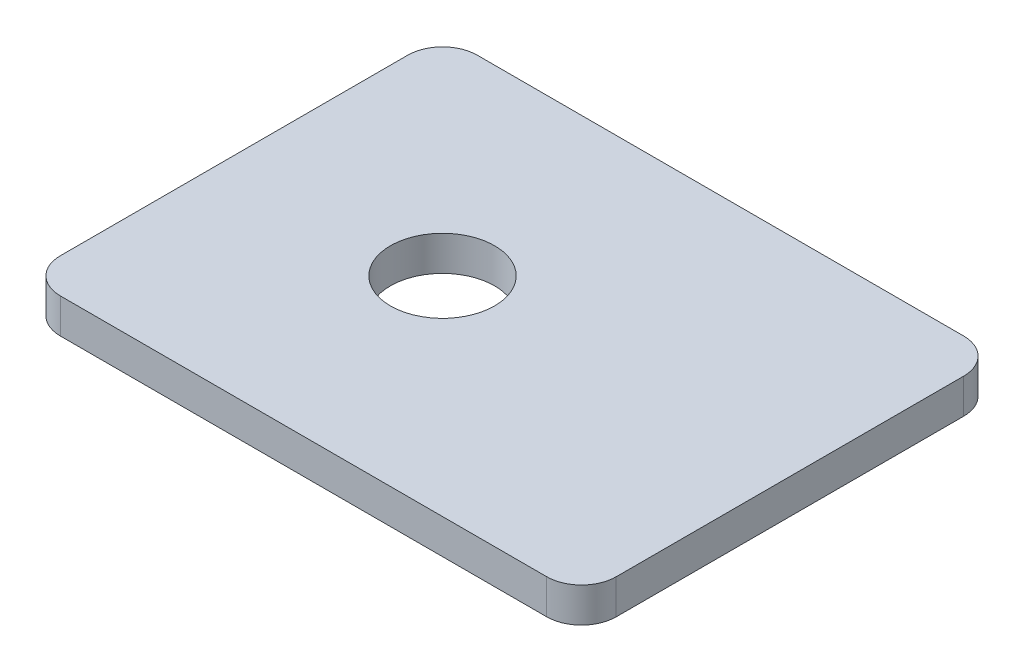
ISO-10303-21;
HEADER;
FILE_DESCRIPTION(('STEP AP214'),'2;1');
FILE_NAME('part.step','',(''),(''),'','','');
FILE_SCHEMA(('AUTOMOTIVE_DESIGN { 1 0 10303 214 1 1 1 1 }'));
ENDSEC;
DATA;
#1=APPLICATION_CONTEXT('core data for automotive mechanical design processes');
#2=APPLICATION_PROTOCOL_DEFINITION('international standard','automotive_design',2000,#1);
#3=PRODUCT_CONTEXT('',#1,'mechanical');
#4=PRODUCT('Part','Part','',(#3));
#5=PRODUCT_RELATED_PRODUCT_CATEGORY('part','',(#4));
#6=PRODUCT_DEFINITION_FORMATION('','',#4);
#7=PRODUCT_DEFINITION_CONTEXT('part definition',#1,'design');
#8=PRODUCT_DEFINITION('design','',#6,#7);
#9=PRODUCT_DEFINITION_SHAPE('','',#8);
#10=(LENGTH_UNIT() NAMED_UNIT(*) SI_UNIT(.MILLI.,.METRE.));
#11=(NAMED_UNIT(*) PLANE_ANGLE_UNIT() SI_UNIT($,.RADIAN.));
#12=(NAMED_UNIT(*) SI_UNIT($,.STERADIAN.) SOLID_ANGLE_UNIT());
#13=UNCERTAINTY_MEASURE_WITH_UNIT(LENGTH_MEASURE(1.E-05),#10,'distance_accuracy_value','');
#14=(GEOMETRIC_REPRESENTATION_CONTEXT(3) GLOBAL_UNCERTAINTY_ASSIGNED_CONTEXT((#13)) GLOBAL_UNIT_ASSIGNED_CONTEXT((#10,
#11,#12)) REPRESENTATION_CONTEXT('',''));
#15=CARTESIAN_POINT('',(0.,0.,0.));
#16=DIRECTION('',(0.,0.,1.));
#17=DIRECTION('',(1.,0.,0.));
#18=AXIS2_PLACEMENT_3D('',#15,#16,#17);
#19=CARTESIAN_POINT('',(3.175,0.,-3.175));
#20=DIRECTION('',(0.,-1.,0.));
#21=DIRECTION('',(0.,0.,-1.));
#22=AXIS2_PLACEMENT_3D('',#19,#20,#21);
#23=PLANE('',#22);
#24=CARTESIAN_POINT('',(3.175,0.,-3.175));
#25=DIRECTION('',(0.,-1.,0.));
#26=DIRECTION('',(0.,0.,-1.));
#27=AXIS2_PLACEMENT_3D('',#24,#25,#26);
#28=CIRCLE('',#27,3.175);
#29=CARTESIAN_POINT('',(3.175,0.,0.));
#30=VERTEX_POINT('',#29);
#31=CARTESIAN_POINT('',(0.,0.,-3.175));
#32=VERTEX_POINT('',#31);
#33=EDGE_CURVE('E145',#30,#32,#28,.T.);
#34=ORIENTED_EDGE('',*,*,#33,.T.);
#35=DIRECTION('',(0.,0.,-1.));
#36=VECTOR('',#35,1.);
#37=CARTESIAN_POINT('',(0.,0.,-3.175));
#38=LINE('',#37,#36);
#39=CARTESIAN_POINT('',(0.,0.,-34.925));
#40=VERTEX_POINT('',#39);
#41=EDGE_CURVE('E148',#32,#40,#38,.T.);
#42=ORIENTED_EDGE('',*,*,#41,.T.);
#43=CARTESIAN_POINT('',(3.175,0.,-34.925));
#44=DIRECTION('',(0.,-1.,0.));
#45=DIRECTION('',(0.,0.,-1.));
#46=AXIS2_PLACEMENT_3D('',#43,#44,#45);
#47=CIRCLE('',#46,3.175);
#48=CARTESIAN_POINT('',(3.175,0.,-38.1));
#49=VERTEX_POINT('',#48);
#50=EDGE_CURVE('E152',#40,#49,#47,.T.);
#51=ORIENTED_EDGE('',*,*,#50,.T.);
#52=DIRECTION('',(1.,0.,0.));
#53=VECTOR('',#52,1.);
#54=CARTESIAN_POINT('',(3.175,0.,-38.1));
#55=LINE('',#54,#53);
#56=CARTESIAN_POINT('',(47.625,0.,-38.1));
#57=VERTEX_POINT('',#56);
#58=EDGE_CURVE('E155',#49,#57,#55,.T.);
#59=ORIENTED_EDGE('',*,*,#58,.T.);
#60=CARTESIAN_POINT('',(47.625,0.,-34.925));
#61=DIRECTION('',(0.,-1.,0.));
#62=DIRECTION('',(0.,0.,-1.));
#63=AXIS2_PLACEMENT_3D('',#60,#61,#62);
#64=CIRCLE('',#63,3.175);
#65=CARTESIAN_POINT('',(50.8,0.,-34.925));
#66=VERTEX_POINT('',#65);
#67=EDGE_CURVE('E158',#57,#66,#64,.T.);
#68=ORIENTED_EDGE('',*,*,#67,.T.);
#69=DIRECTION('',(0.,0.,-1.));
#70=VECTOR('',#69,1.);
#71=CARTESIAN_POINT('',(50.8,0.,-3.175));
#72=LINE('',#71,#70);
#73=CARTESIAN_POINT('',(50.8,0.,-3.175));
#74=VERTEX_POINT('',#73);
#75=EDGE_CURVE('E161',#74,#66,#72,.T.);
#76=ORIENTED_EDGE('',*,*,#75,.F.);
#77=CARTESIAN_POINT('',(47.625,0.,-3.175));
#78=DIRECTION('',(0.,1.,0.));
#79=DIRECTION('',(0.,0.,1.));
#80=AXIS2_PLACEMENT_3D('',#77,#78,#79);
#81=CIRCLE('',#80,3.175);
#82=CARTESIAN_POINT('',(47.625,0.,0.));
#83=VERTEX_POINT('',#82);
#84=EDGE_CURVE('E130',#83,#74,#81,.T.);
#85=ORIENTED_EDGE('',*,*,#84,.F.);
#86=DIRECTION('',(1.,0.,0.));
#87=VECTOR('',#86,1.);
#88=CARTESIAN_POINT('',(3.175,0.,0.));
#89=LINE('',#88,#87);
#90=EDGE_CURVE('E91',#30,#83,#89,.T.);
#91=ORIENTED_EDGE('',*,*,#90,.F.);
#92=EDGE_LOOP('',(#34,#42,#51,#59,#68,#76,#85,#91));
#93=FACE_BOUND('',#92,.T.);
#94=CARTESIAN_POINT('',(19.05,0.,-19.05));
#95=DIRECTION('',(0.,1.,0.));
#96=DIRECTION('',(0.,0.,1.));
#97=AXIS2_PLACEMENT_3D('',#94,#95,#96);
#98=CIRCLE('',#97,4.7625);
#99=CARTESIAN_POINT('',(19.05,0.,-14.2875));
#100=VERTEX_POINT('',#99);
#101=EDGE_CURVE('E149',#100,#100,#98,.T.);
#102=ORIENTED_EDGE('',*,*,#101,.T.);
#103=EDGE_LOOP('',(#102));
#104=FACE_BOUND('',#103,.T.);
#105=ADVANCED_FACE('F45',(#93,#104),#23,.T.);
#106=CARTESIAN_POINT('',(3.175,3.175,-3.175));
#107=DIRECTION('',(0.,-1.,0.));
#108=DIRECTION('',(0.,0.,-1.));
#109=AXIS2_PLACEMENT_3D('',#106,#107,#108);
#110=CYLINDRICAL_SURFACE('',#109,3.175);
#111=ORIENTED_EDGE('',*,*,#33,.F.);
#112=DIRECTION('',(0.,-1.,0.));
#113=VECTOR('',#112,1.);
#114=CARTESIAN_POINT('',(3.175,3.175,0.));
#115=LINE('',#114,#113);
#116=CARTESIAN_POINT('',(3.175,3.175,0.));
#117=VERTEX_POINT('',#116);
#118=EDGE_CURVE('E13',#117,#30,#115,.T.);
#119=ORIENTED_EDGE('',*,*,#118,.F.);
#120=CARTESIAN_POINT('',(3.175,3.175,-3.175));
#121=DIRECTION('',(0.,-1.,0.));
#122=DIRECTION('',(0.,0.,-1.));
#123=AXIS2_PLACEMENT_3D('',#120,#121,#122);
#124=CIRCLE('',#123,3.175);
#125=CARTESIAN_POINT('',(0.,3.175,-3.175));
#126=VERTEX_POINT('',#125);
#127=EDGE_CURVE('E164',#117,#126,#124,.T.);
#128=ORIENTED_EDGE('',*,*,#127,.T.);
#129=DIRECTION('',(0.,-1.,0.));
#130=VECTOR('',#129,1.);
#131=CARTESIAN_POINT('',(0.,3.175,-3.175));
#132=LINE('',#131,#130);
#133=EDGE_CURVE('E49',#126,#32,#132,.T.);
#134=ORIENTED_EDGE('',*,*,#133,.T.);
#135=EDGE_LOOP('',(#111,#119,#128,#134));
#136=FACE_BOUND('',#135,.T.);
#137=ADVANCED_FACE('F47',(#136),#110,.T.);
#138=CARTESIAN_POINT('',(3.175,3.175,0.));
#139=DIRECTION('',(0.,0.,-1.));
#140=DIRECTION('',(-1.,0.,0.));
#141=AXIS2_PLACEMENT_3D('',#138,#139,#140);
#142=PLANE('',#141);
#143=ORIENTED_EDGE('',*,*,#90,.T.);
#144=DIRECTION('',(0.,-1.,0.));
#145=VECTOR('',#144,1.);
#146=CARTESIAN_POINT('',(47.625,3.175,0.));
#147=LINE('',#146,#145);
#148=CARTESIAN_POINT('',(47.625,3.175,0.));
#149=VERTEX_POINT('',#148);
#150=EDGE_CURVE('E55',#149,#83,#147,.T.);
#151=ORIENTED_EDGE('',*,*,#150,.F.);
#152=DIRECTION('',(1.,0.,0.));
#153=VECTOR('',#152,1.);
#154=CARTESIAN_POINT('',(3.175,3.175,0.));
#155=LINE('',#154,#153);
#156=EDGE_CURVE('E123',#117,#149,#155,.T.);
#157=ORIENTED_EDGE('',*,*,#156,.F.);
#158=ORIENTED_EDGE('',*,*,#118,.T.);
#159=EDGE_LOOP('',(#143,#151,#157,#158));
#160=FACE_BOUND('',#159,.T.);
#161=ADVANCED_FACE('F214',(#160),#142,.F.);
#162=CARTESIAN_POINT('',(47.625,3.175,-3.175));
#163=DIRECTION('',(0.,-1.,0.));
#164=DIRECTION('',(0.,0.,-1.));
#165=AXIS2_PLACEMENT_3D('',#162,#163,#164);
#166=CYLINDRICAL_SURFACE('',#165,3.175);
#167=ORIENTED_EDGE('',*,*,#84,.T.);
#168=DIRECTION('',(0.,-1.,0.));
#169=VECTOR('',#168,1.);
#170=CARTESIAN_POINT('',(50.8,3.175,-3.175));
#171=LINE('',#170,#169);
#172=CARTESIAN_POINT('',(50.8,3.175,-3.175));
#173=VERTEX_POINT('',#172);
#174=EDGE_CURVE('E127',#173,#74,#171,.T.);
#175=ORIENTED_EDGE('',*,*,#174,.F.);
#176=CARTESIAN_POINT('',(47.625,3.175,-3.175));
#177=DIRECTION('',(0.,1.,0.));
#178=DIRECTION('',(0.,0.,1.));
#179=AXIS2_PLACEMENT_3D('',#176,#177,#178);
#180=CIRCLE('',#179,3.175);
#181=EDGE_CURVE('E115',#149,#173,#180,.T.);
#182=ORIENTED_EDGE('',*,*,#181,.F.);
#183=ORIENTED_EDGE('',*,*,#150,.T.);
#184=EDGE_LOOP('',(#167,#175,#182,#183));
#185=FACE_BOUND('',#184,.T.);
#186=ADVANCED_FACE('F128',(#185),#166,.T.);
#187=CARTESIAN_POINT('',(50.8,3.175,-3.175));
#188=DIRECTION('',(-1.,0.,0.));
#189=DIRECTION('',(0.,0.,1.));
#190=AXIS2_PLACEMENT_3D('',#187,#188,#189);
#191=PLANE('',#190);
#192=ORIENTED_EDGE('',*,*,#75,.T.);
#193=DIRECTION('',(0.,-1.,0.));
#194=VECTOR('',#193,1.);
#195=CARTESIAN_POINT('',(50.8,3.175,-34.925));
#196=LINE('',#195,#194);
#197=CARTESIAN_POINT('',(50.8,3.175,-34.925));
#198=VERTEX_POINT('',#197);
#199=EDGE_CURVE('E134',#198,#66,#196,.T.);
#200=ORIENTED_EDGE('',*,*,#199,.F.);
#201=DIRECTION('',(0.,0.,-1.));
#202=VECTOR('',#201,1.);
#203=CARTESIAN_POINT('',(50.8,3.175,-3.175));
#204=LINE('',#203,#202);
#205=EDGE_CURVE('E121',#173,#198,#204,.T.);
#206=ORIENTED_EDGE('',*,*,#205,.F.);
#207=ORIENTED_EDGE('',*,*,#174,.T.);
#208=EDGE_LOOP('',(#192,#200,#206,#207));
#209=FACE_BOUND('',#208,.T.);
#210=ADVANCED_FACE('F136',(#209),#191,.F.);
#211=CARTESIAN_POINT('',(47.625,3.175,-34.925));
#212=DIRECTION('',(0.,-1.,0.));
#213=DIRECTION('',(0.,0.,-1.));
#214=AXIS2_PLACEMENT_3D('',#211,#212,#213);
#215=CYLINDRICAL_SURFACE('',#214,3.175);
#216=ORIENTED_EDGE('',*,*,#67,.F.);
#217=DIRECTION('',(0.,-1.,0.));
#218=VECTOR('',#217,1.);
#219=CARTESIAN_POINT('',(47.625,3.175,-38.1));
#220=LINE('',#219,#218);
#221=CARTESIAN_POINT('',(47.625,3.175,-38.1));
#222=VERTEX_POINT('',#221);
#223=EDGE_CURVE('E168',#222,#57,#220,.T.);
#224=ORIENTED_EDGE('',*,*,#223,.F.);
#225=CARTESIAN_POINT('',(47.625,3.175,-34.925));
#226=DIRECTION('',(0.,-1.,0.));
#227=DIRECTION('',(0.,0.,-1.));
#228=AXIS2_PLACEMENT_3D('',#225,#226,#227);
#229=CIRCLE('',#228,3.175);
#230=EDGE_CURVE('E138',#222,#198,#229,.T.);
#231=ORIENTED_EDGE('',*,*,#230,.T.);
#232=ORIENTED_EDGE('',*,*,#199,.T.);
#233=EDGE_LOOP('',(#216,#224,#231,#232));
#234=FACE_BOUND('',#233,.T.);
#235=ADVANCED_FACE('F179',(#234),#215,.T.);
#236=CARTESIAN_POINT('',(3.175,3.175,-38.1));
#237=DIRECTION('',(0.,0.,-1.));
#238=DIRECTION('',(-1.,0.,0.));
#239=AXIS2_PLACEMENT_3D('',#236,#237,#238);
#240=PLANE('',#239);
#241=ORIENTED_EDGE('',*,*,#58,.F.);
#242=DIRECTION('',(0.,-1.,0.));
#243=VECTOR('',#242,1.);
#244=CARTESIAN_POINT('',(3.175,3.175,-38.1));
#245=LINE('',#244,#243);
#246=CARTESIAN_POINT('',(3.175,3.175,-38.1));
#247=VERTEX_POINT('',#246);
#248=EDGE_CURVE('E170',#247,#49,#245,.T.);
#249=ORIENTED_EDGE('',*,*,#248,.F.);
#250=DIRECTION('',(1.,0.,0.));
#251=VECTOR('',#250,1.);
#252=CARTESIAN_POINT('',(3.175,3.175,-38.1));
#253=LINE('',#252,#251);
#254=EDGE_CURVE('E140',#247,#222,#253,.T.);
#255=ORIENTED_EDGE('',*,*,#254,.T.);
#256=ORIENTED_EDGE('',*,*,#223,.T.);
#257=EDGE_LOOP('',(#241,#249,#255,#256));
#258=FACE_BOUND('',#257,.T.);
#259=ADVANCED_FACE('F185',(#258),#240,.T.);
#260=CARTESIAN_POINT('',(3.175,3.175,-34.925));
#261=DIRECTION('',(0.,-1.,0.));
#262=DIRECTION('',(0.,0.,-1.));
#263=AXIS2_PLACEMENT_3D('',#260,#261,#262);
#264=CYLINDRICAL_SURFACE('',#263,3.175);
#265=ORIENTED_EDGE('',*,*,#50,.F.);
#266=DIRECTION('',(0.,-1.,0.));
#267=VECTOR('',#266,1.);
#268=CARTESIAN_POINT('',(0.,3.175,-34.925));
#269=LINE('',#268,#267);
#270=CARTESIAN_POINT('',(0.,3.175,-34.925));
#271=VERTEX_POINT('',#270);
#272=EDGE_CURVE('E171',#271,#40,#269,.T.);
#273=ORIENTED_EDGE('',*,*,#272,.F.);
#274=CARTESIAN_POINT('',(3.175,3.175,-34.925));
#275=DIRECTION('',(0.,-1.,0.));
#276=DIRECTION('',(0.,0.,-1.));
#277=AXIS2_PLACEMENT_3D('',#274,#275,#276);
#278=CIRCLE('',#277,3.175);
#279=EDGE_CURVE('E186',#271,#247,#278,.T.);
#280=ORIENTED_EDGE('',*,*,#279,.T.);
#281=ORIENTED_EDGE('',*,*,#248,.T.);
#282=EDGE_LOOP('',(#265,#273,#280,#281));
#283=FACE_BOUND('',#282,.T.);
#284=ADVANCED_FACE('F208',(#283),#264,.T.);
#285=CARTESIAN_POINT('',(0.,3.175,-3.175));
#286=DIRECTION('',(-1.,0.,0.));
#287=DIRECTION('',(0.,0.,1.));
#288=AXIS2_PLACEMENT_3D('',#285,#286,#287);
#289=PLANE('',#288);
#290=ORIENTED_EDGE('',*,*,#41,.F.);
#291=ORIENTED_EDGE('',*,*,#133,.F.);
#292=DIRECTION('',(0.,0.,-1.));
#293=VECTOR('',#292,1.);
#294=CARTESIAN_POINT('',(0.,3.175,-3.175));
#295=LINE('',#294,#293);
#296=EDGE_CURVE('E187',#126,#271,#295,.T.);
#297=ORIENTED_EDGE('',*,*,#296,.T.);
#298=ORIENTED_EDGE('',*,*,#272,.T.);
#299=EDGE_LOOP('',(#290,#291,#297,#298));
#300=FACE_BOUND('',#299,.T.);
#301=ADVANCED_FACE('F173',(#300),#289,.T.);
#302=CARTESIAN_POINT('',(3.175,3.175,-3.175));
#303=DIRECTION('',(0.,-1.,0.));
#304=DIRECTION('',(0.,0.,-1.));
#305=AXIS2_PLACEMENT_3D('',#302,#303,#304);
#306=PLANE('',#305);
#307=CARTESIAN_POINT('',(19.05,3.175,-19.05));
#308=DIRECTION('',(0.,1.,0.));
#309=DIRECTION('',(0.,0.,1.));
#310=AXIS2_PLACEMENT_3D('',#307,#308,#309);
#311=CIRCLE('',#310,4.7625);
#312=CARTESIAN_POINT('',(19.05,3.175,-14.2875));
#313=VERTEX_POINT('',#312);
#314=EDGE_CURVE('E194',#313,#313,#311,.T.);
#315=ORIENTED_EDGE('',*,*,#314,.F.);
#316=EDGE_LOOP('',(#315));
#317=FACE_BOUND('',#316,.T.);
#318=ORIENTED_EDGE('',*,*,#127,.F.);
#319=ORIENTED_EDGE('',*,*,#156,.T.);
#320=ORIENTED_EDGE('',*,*,#181,.T.);
#321=ORIENTED_EDGE('',*,*,#205,.T.);
#322=ORIENTED_EDGE('',*,*,#230,.F.);
#323=ORIENTED_EDGE('',*,*,#254,.F.);
#324=ORIENTED_EDGE('',*,*,#279,.F.);
#325=ORIENTED_EDGE('',*,*,#296,.F.);
#326=EDGE_LOOP('',(#318,#319,#320,#321,#322,#323,#324,#325));
#327=FACE_BOUND('',#326,.T.);
#328=ADVANCED_FACE('F118',(#317,#327),#306,.F.);
#329=CARTESIAN_POINT('',(19.05,3.175,-19.05));
#330=DIRECTION('',(0.,1.,0.));
#331=DIRECTION('',(0.,0.,1.));
#332=AXIS2_PLACEMENT_3D('',#329,#330,#331);
#333=CYLINDRICAL_SURFACE('',#332,4.7625);
#334=ORIENTED_EDGE('',*,*,#101,.F.);
#335=EDGE_LOOP('',(#334));
#336=FACE_BOUND('',#335,.T.);
#337=ORIENTED_EDGE('',*,*,#314,.T.);
#338=EDGE_LOOP('',(#337));
#339=FACE_BOUND('',#338,.T.);
#340=ADVANCED_FACE('F198',(#336,#339),#333,.F.);
#341=CLOSED_SHELL('',(#105,#137,#161,#186,#210,#235,#259,#284,#301,#328,#340));
#342=MANIFOLD_SOLID_BREP('B2',#341);
#343=ADVANCED_BREP_SHAPE_REPRESENTATION('',(#18,#342),#14);
#344=SHAPE_DEFINITION_REPRESENTATION(#9,#343);
ENDSEC;
END-ISO-10303-21;
